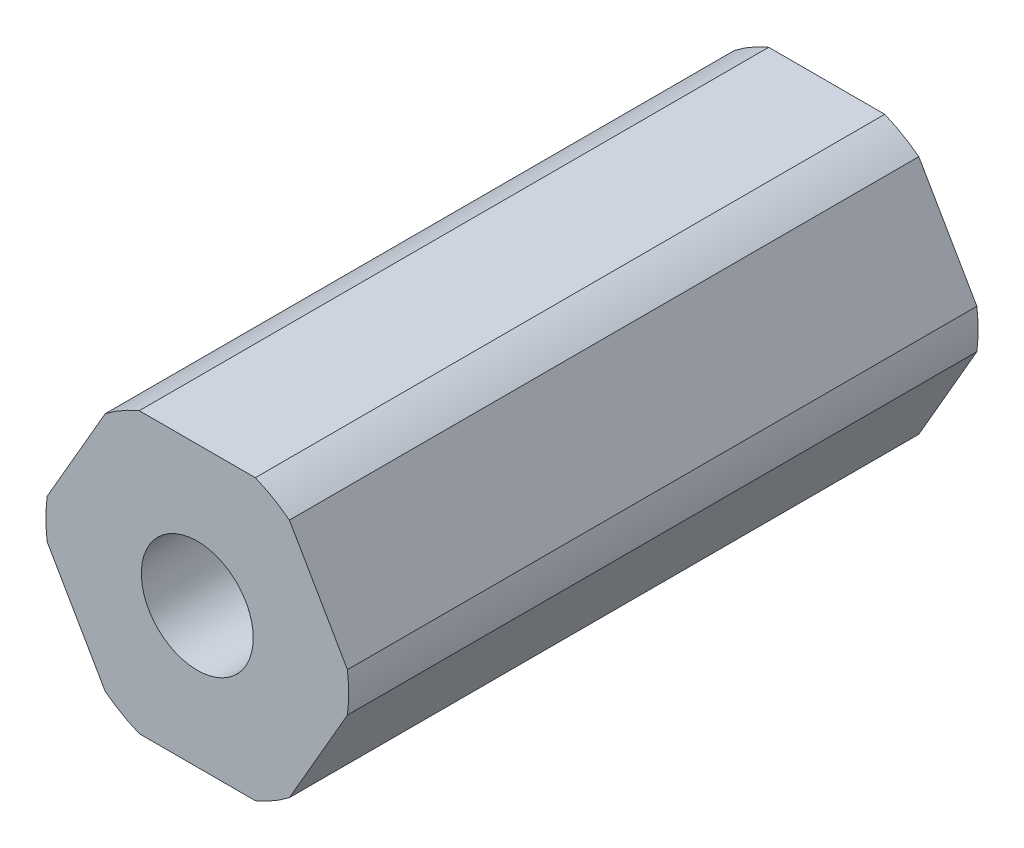
ISO-10303-21;
HEADER;
FILE_DESCRIPTION(('STEP AP214'),'2;1');
FILE_NAME('part.step','',(''),(''),'','','');
FILE_SCHEMA(('AUTOMOTIVE_DESIGN { 1 0 10303 214 1 1 1 1 }'));
ENDSEC;
DATA;
#1=APPLICATION_CONTEXT('core data for automotive mechanical design processes');
#2=APPLICATION_PROTOCOL_DEFINITION('international standard','automotive_design',2000,#1);
#3=PRODUCT_CONTEXT('',#1,'mechanical');
#4=PRODUCT('Part','Part','',(#3));
#5=PRODUCT_RELATED_PRODUCT_CATEGORY('part','',(#4));
#6=PRODUCT_DEFINITION_FORMATION('','',#4);
#7=PRODUCT_DEFINITION_CONTEXT('part definition',#1,'design');
#8=PRODUCT_DEFINITION('design','',#6,#7);
#9=PRODUCT_DEFINITION_SHAPE('','',#8);
#10=(LENGTH_UNIT() NAMED_UNIT(*) SI_UNIT(.MILLI.,.METRE.));
#11=(NAMED_UNIT(*) PLANE_ANGLE_UNIT() SI_UNIT($,.RADIAN.));
#12=(NAMED_UNIT(*) SI_UNIT($,.STERADIAN.) SOLID_ANGLE_UNIT());
#13=UNCERTAINTY_MEASURE_WITH_UNIT(LENGTH_MEASURE(1.E-05),#10,'distance_accuracy_value','');
#14=(GEOMETRIC_REPRESENTATION_CONTEXT(3) GLOBAL_UNCERTAINTY_ASSIGNED_CONTEXT((#13)) GLOBAL_UNIT_ASSIGNED_CONTEXT((#10,
#11,#12)) REPRESENTATION_CONTEXT('',''));
#15=CARTESIAN_POINT('',(0.,0.,0.));
#16=DIRECTION('',(0.,0.,1.));
#17=DIRECTION('',(1.,0.,0.));
#18=AXIS2_PLACEMENT_3D('',#15,#16,#17);
#19=CARTESIAN_POINT('',(0.,0.,28.575));
#20=DIRECTION('',(0.,0.,1.));
#21=DIRECTION('',(1.,0.,0.));
#22=AXIS2_PLACEMENT_3D('',#19,#20,#21);
#23=PLANE('',#22);
#24=CARTESIAN_POINT('',(0.,0.,28.575));
#25=DIRECTION('',(0.,0.,1.));
#26=DIRECTION('',(1.,0.,0.));
#27=AXIS2_PLACEMENT_3D('',#24,#25,#26);
#28=CIRCLE('',#27,6.87499999999999);
#29=CARTESIAN_POINT('',(6.81675182633098,-0.893039494206809,28.575));
#30=VERTEX_POINT('',#29);
#31=CARTESIAN_POINT('',(6.81675182633098,0.893039494206813,28.575));
#32=VERTEX_POINT('',#31);
#33=EDGE_CURVE('E177',#30,#32,#28,.T.);
#34=ORIENTED_EDGE('',*,*,#33,.T.);
#35=DIRECTION('',(-0.5,0.866025403784438,0.));
#36=VECTOR('',#35,1.);
#37=CARTESIAN_POINT('',(6.81675182633098,0.893039494206813,28.575));
#38=LINE('',#37,#36);
#39=CARTESIAN_POINT('',(4.18177080173139,5.45696050579319,28.575));
#40=VERTEX_POINT('',#39);
#41=EDGE_CURVE('E105',#32,#40,#38,.T.);
#42=ORIENTED_EDGE('',*,*,#41,.T.);
#43=CARTESIAN_POINT('',(0.,0.,28.575));
#44=DIRECTION('',(0.,0.,1.));
#45=DIRECTION('',(1.,0.,0.));
#46=AXIS2_PLACEMENT_3D('',#43,#44,#45);
#47=CIRCLE('',#46,6.87499999999999);
#48=CARTESIAN_POINT('',(2.63498102459958,6.35,28.575));
#49=VERTEX_POINT('',#48);
#50=EDGE_CURVE('E204',#40,#49,#47,.T.);
#51=ORIENTED_EDGE('',*,*,#50,.T.);
#52=DIRECTION('',(-1.,0.,0.));
#53=VECTOR('',#52,1.);
#54=CARTESIAN_POINT('',(2.63498102459958,6.35,28.575));
#55=LINE('',#54,#53);
#56=CARTESIAN_POINT('',(-2.63498102459958,6.35,28.575));
#57=VERTEX_POINT('',#56);
#58=EDGE_CURVE('E223',#49,#57,#55,.T.);
#59=ORIENTED_EDGE('',*,*,#58,.T.);
#60=CARTESIAN_POINT('',(0.,0.,28.575));
#61=DIRECTION('',(0.,0.,1.));
#62=DIRECTION('',(1.,0.,0.));
#63=AXIS2_PLACEMENT_3D('',#60,#61,#62);
#64=CIRCLE('',#63,6.87499999999999);
#65=CARTESIAN_POINT('',(-4.1817708017314,5.45696050579319,28.575));
#66=VERTEX_POINT('',#65);
#67=EDGE_CURVE('E220',#57,#66,#64,.T.);
#68=ORIENTED_EDGE('',*,*,#67,.T.);
#69=DIRECTION('',(-0.5,-0.866025403784439,0.));
#70=VECTOR('',#69,1.);
#71=CARTESIAN_POINT('',(-4.1817708017314,5.45696050579319,28.575));
#72=LINE('',#71,#70);
#73=CARTESIAN_POINT('',(-6.81675182633098,0.893039494206816,28.575));
#74=VERTEX_POINT('',#73);
#75=EDGE_CURVE('E222',#66,#74,#72,.T.);
#76=ORIENTED_EDGE('',*,*,#75,.T.);
#77=CARTESIAN_POINT('',(0.,0.,28.575));
#78=DIRECTION('',(0.,0.,1.));
#79=DIRECTION('',(1.,0.,0.));
#80=AXIS2_PLACEMENT_3D('',#77,#78,#79);
#81=CIRCLE('',#80,6.87499999999999);
#82=CARTESIAN_POINT('',(-6.81675182633098,-0.89303949420682,28.575));
#83=VERTEX_POINT('',#82);
#84=EDGE_CURVE('E225',#74,#83,#81,.T.);
#85=ORIENTED_EDGE('',*,*,#84,.T.);
#86=DIRECTION('',(0.5,-0.866025403784438,0.));
#87=VECTOR('',#86,1.);
#88=CARTESIAN_POINT('',(-6.81675182633098,-0.893039494206822,28.575));
#89=LINE('',#88,#87);
#90=CARTESIAN_POINT('',(-4.1817708017314,-5.45696050579319,28.575));
#91=VERTEX_POINT('',#90);
#92=EDGE_CURVE('E231',#83,#91,#89,.T.);
#93=ORIENTED_EDGE('',*,*,#92,.T.);
#94=CARTESIAN_POINT('',(0.,0.,28.575));
#95=DIRECTION('',(0.,0.,1.));
#96=DIRECTION('',(1.,0.,0.));
#97=AXIS2_PLACEMENT_3D('',#94,#95,#96);
#98=CIRCLE('',#97,6.87499999999999);
#99=CARTESIAN_POINT('',(-2.63498102459958,-6.35,28.575));
#100=VERTEX_POINT('',#99);
#101=EDGE_CURVE('E136',#91,#100,#98,.T.);
#102=ORIENTED_EDGE('',*,*,#101,.T.);
#103=DIRECTION('',(1.,0.,0.));
#104=VECTOR('',#103,1.);
#105=CARTESIAN_POINT('',(-2.63498102459958,-6.35,28.575));
#106=LINE('',#105,#104);
#107=CARTESIAN_POINT('',(2.63498102459958,-6.35,28.575));
#108=VERTEX_POINT('',#107);
#109=EDGE_CURVE('E130',#100,#108,#106,.T.);
#110=ORIENTED_EDGE('',*,*,#109,.T.);
#111=CARTESIAN_POINT('',(0.,0.,28.575));
#112=DIRECTION('',(0.,0.,1.));
#113=DIRECTION('',(1.,0.,0.));
#114=AXIS2_PLACEMENT_3D('',#111,#112,#113);
#115=CIRCLE('',#114,6.87499999999999);
#116=CARTESIAN_POINT('',(4.18177080173139,-5.45696050579319,28.575));
#117=VERTEX_POINT('',#116);
#118=EDGE_CURVE('E134',#108,#117,#115,.T.);
#119=ORIENTED_EDGE('',*,*,#118,.T.);
#120=DIRECTION('',(0.5,0.866025403784439,0.));
#121=VECTOR('',#120,1.);
#122=CARTESIAN_POINT('',(4.18177080173139,-5.45696050579319,28.575));
#123=LINE('',#122,#121);
#124=EDGE_CURVE('E50',#117,#30,#123,.T.);
#125=ORIENTED_EDGE('',*,*,#124,.T.);
#126=EDGE_LOOP('',(#34,#42,#51,#59,#68,#76,#85,#93,#102,#110,#119,#125));
#127=FACE_BOUND('',#126,.T.);
#128=CARTESIAN_POINT('',(0.,0.,28.575));
#129=DIRECTION('',(0.,0.,1.));
#130=DIRECTION('',(1.,0.,0.));
#131=AXIS2_PLACEMENT_3D('',#128,#129,#130);
#132=CIRCLE('',#131,2.54);
#133=CARTESIAN_POINT('',(2.54,0.,28.575));
#134=VERTEX_POINT('',#133);
#135=EDGE_CURVE('E158',#134,#134,#132,.T.);
#136=ORIENTED_EDGE('',*,*,#135,.F.);
#137=EDGE_LOOP('',(#136));
#138=FACE_BOUND('',#137,.T.);
#139=ADVANCED_FACE('F33',(#127,#138),#23,.T.);
#140=CARTESIAN_POINT('',(0.,0.,0.));
#141=DIRECTION('',(0.,0.,1.));
#142=DIRECTION('',(1.,0.,0.));
#143=AXIS2_PLACEMENT_3D('',#140,#141,#142);
#144=PLANE('',#143);
#145=CARTESIAN_POINT('',(0.,0.,0.));
#146=DIRECTION('',(0.,0.,1.));
#147=DIRECTION('',(1.,0.,0.));
#148=AXIS2_PLACEMENT_3D('',#145,#146,#147);
#149=CIRCLE('',#148,6.87499999999999);
#150=CARTESIAN_POINT('',(6.81675182633098,-0.893039494206809,0.));
#151=VERTEX_POINT('',#150);
#152=CARTESIAN_POINT('',(6.81675182633098,0.893039494206813,0.));
#153=VERTEX_POINT('',#152);
#154=EDGE_CURVE('E154',#151,#153,#149,.T.);
#155=ORIENTED_EDGE('',*,*,#154,.F.);
#156=DIRECTION('',(0.5,0.866025403784439,0.));
#157=VECTOR('',#156,1.);
#158=CARTESIAN_POINT('',(4.18177080173139,-5.45696050579319,0.));
#159=LINE('',#158,#157);
#160=CARTESIAN_POINT('',(4.18177080173139,-5.45696050579319,0.));
#161=VERTEX_POINT('',#160);
#162=EDGE_CURVE('E97',#161,#151,#159,.T.);
#163=ORIENTED_EDGE('',*,*,#162,.F.);
#164=CARTESIAN_POINT('',(0.,0.,0.));
#165=DIRECTION('',(0.,0.,1.));
#166=DIRECTION('',(1.,0.,0.));
#167=AXIS2_PLACEMENT_3D('',#164,#165,#166);
#168=CIRCLE('',#167,6.87499999999999);
#169=CARTESIAN_POINT('',(2.63498102459958,-6.35,0.));
#170=VERTEX_POINT('',#169);
#171=EDGE_CURVE('E91',#170,#161,#168,.T.);
#172=ORIENTED_EDGE('',*,*,#171,.F.);
#173=DIRECTION('',(1.,0.,0.));
#174=VECTOR('',#173,1.);
#175=CARTESIAN_POINT('',(-2.63498102459958,-6.35,0.));
#176=LINE('',#175,#174);
#177=CARTESIAN_POINT('',(-2.63498102459958,-6.35,0.));
#178=VERTEX_POINT('',#177);
#179=EDGE_CURVE('E144',#178,#170,#176,.T.);
#180=ORIENTED_EDGE('',*,*,#179,.F.);
#181=CARTESIAN_POINT('',(0.,0.,0.));
#182=DIRECTION('',(0.,0.,1.));
#183=DIRECTION('',(1.,0.,0.));
#184=AXIS2_PLACEMENT_3D('',#181,#182,#183);
#185=CIRCLE('',#184,6.87499999999999);
#186=CARTESIAN_POINT('',(-4.1817708017314,-5.45696050579319,0.));
#187=VERTEX_POINT('',#186);
#188=EDGE_CURVE('E172',#187,#178,#185,.T.);
#189=ORIENTED_EDGE('',*,*,#188,.F.);
#190=DIRECTION('',(0.5,-0.866025403784438,0.));
#191=VECTOR('',#190,1.);
#192=CARTESIAN_POINT('',(-6.81675182633098,-0.893039494206822,0.));
#193=LINE('',#192,#191);
#194=CARTESIAN_POINT('',(-6.81675182633098,-0.89303949420682,0.));
#195=VERTEX_POINT('',#194);
#196=EDGE_CURVE('E170',#195,#187,#193,.T.);
#197=ORIENTED_EDGE('',*,*,#196,.F.);
#198=CARTESIAN_POINT('',(0.,0.,0.));
#199=DIRECTION('',(0.,0.,1.));
#200=DIRECTION('',(1.,0.,0.));
#201=AXIS2_PLACEMENT_3D('',#198,#199,#200);
#202=CIRCLE('',#201,6.87499999999999);
#203=CARTESIAN_POINT('',(-6.81675182633098,0.893039494206816,0.));
#204=VERTEX_POINT('',#203);
#205=EDGE_CURVE('E168',#204,#195,#202,.T.);
#206=ORIENTED_EDGE('',*,*,#205,.F.);
#207=DIRECTION('',(-0.5,-0.866025403784439,0.));
#208=VECTOR('',#207,1.);
#209=CARTESIAN_POINT('',(-4.1817708017314,5.45696050579319,0.));
#210=LINE('',#209,#208);
#211=CARTESIAN_POINT('',(-4.1817708017314,5.45696050579319,0.));
#212=VERTEX_POINT('',#211);
#213=EDGE_CURVE('E166',#212,#204,#210,.T.);
#214=ORIENTED_EDGE('',*,*,#213,.F.);
#215=CARTESIAN_POINT('',(0.,0.,0.));
#216=DIRECTION('',(0.,0.,1.));
#217=DIRECTION('',(1.,0.,0.));
#218=AXIS2_PLACEMENT_3D('',#215,#216,#217);
#219=CIRCLE('',#218,6.87499999999999);
#220=CARTESIAN_POINT('',(-2.63498102459958,6.35,0.));
#221=VERTEX_POINT('',#220);
#222=EDGE_CURVE('E164',#221,#212,#219,.T.);
#223=ORIENTED_EDGE('',*,*,#222,.F.);
#224=DIRECTION('',(-1.,0.,0.));
#225=VECTOR('',#224,1.);
#226=CARTESIAN_POINT('',(2.63498102459958,6.35,0.));
#227=LINE('',#226,#225);
#228=CARTESIAN_POINT('',(2.63498102459958,6.35,0.));
#229=VERTEX_POINT('',#228);
#230=EDGE_CURVE('E162',#229,#221,#227,.T.);
#231=ORIENTED_EDGE('',*,*,#230,.F.);
#232=CARTESIAN_POINT('',(0.,0.,0.));
#233=DIRECTION('',(0.,0.,1.));
#234=DIRECTION('',(1.,0.,0.));
#235=AXIS2_PLACEMENT_3D('',#232,#233,#234);
#236=CIRCLE('',#235,6.87499999999999);
#237=CARTESIAN_POINT('',(4.18177080173139,5.45696050579319,0.));
#238=VERTEX_POINT('',#237);
#239=EDGE_CURVE('E160',#238,#229,#236,.T.);
#240=ORIENTED_EDGE('',*,*,#239,.F.);
#241=DIRECTION('',(-0.5,0.866025403784438,0.));
#242=VECTOR('',#241,1.);
#243=CARTESIAN_POINT('',(6.81675182633098,0.893039494206813,0.));
#244=LINE('',#243,#242);
#245=EDGE_CURVE('E157',#153,#238,#244,.T.);
#246=ORIENTED_EDGE('',*,*,#245,.F.);
#247=EDGE_LOOP('',(#155,#163,#172,#180,#189,#197,#206,#214,#223,#231,#240,#246));
#248=FACE_BOUND('',#247,.T.);
#249=CARTESIAN_POINT('',(0.,0.,0.));
#250=DIRECTION('',(0.,0.,1.));
#251=DIRECTION('',(1.,0.,0.));
#252=AXIS2_PLACEMENT_3D('',#249,#250,#251);
#253=CIRCLE('',#252,2.54);
#254=CARTESIAN_POINT('',(2.54,0.,0.));
#255=VERTEX_POINT('',#254);
#256=EDGE_CURVE('E378',#255,#255,#253,.T.);
#257=ORIENTED_EDGE('',*,*,#256,.T.);
#258=EDGE_LOOP('',(#257));
#259=FACE_BOUND('',#258,.T.);
#260=ADVANCED_FACE('F208',(#248,#259),#144,.F.);
#261=CARTESIAN_POINT('',(0.,0.,28.575));
#262=DIRECTION('',(0.,0.,-1.));
#263=DIRECTION('',(-1.,0.,0.));
#264=AXIS2_PLACEMENT_3D('',#261,#262,#263);
#265=CYLINDRICAL_SURFACE('',#264,6.87499999999999);
#266=ORIENTED_EDGE('',*,*,#154,.T.);
#267=DIRECTION('',(0.,0.,-1.));
#268=VECTOR('',#267,1.);
#269=CARTESIAN_POINT('',(6.81675182633098,0.893039494206813,28.575));
#270=LINE('',#269,#268);
#271=EDGE_CURVE('E11',#32,#153,#270,.T.);
#272=ORIENTED_EDGE('',*,*,#271,.F.);
#273=ORIENTED_EDGE('',*,*,#33,.F.);
#274=DIRECTION('',(0.,0.,-1.));
#275=VECTOR('',#274,1.);
#276=CARTESIAN_POINT('',(6.81675182633098,-0.893039494206809,28.575));
#277=LINE('',#276,#275);
#278=EDGE_CURVE('E150',#30,#151,#277,.T.);
#279=ORIENTED_EDGE('',*,*,#278,.T.);
#280=EDGE_LOOP('',(#266,#272,#273,#279));
#281=FACE_BOUND('',#280,.T.);
#282=ADVANCED_FACE('F35',(#281),#265,.T.);
#283=CARTESIAN_POINT('',(6.81675182633098,0.893039494206813,28.575));
#284=DIRECTION('',(-0.866025403784438,-0.5,0.));
#285=DIRECTION('',(0.5,-0.866025403784439,0.));
#286=AXIS2_PLACEMENT_3D('',#283,#284,#285);
#287=PLANE('',#286);
#288=ORIENTED_EDGE('',*,*,#245,.T.);
#289=DIRECTION('',(0.,0.,-1.));
#290=VECTOR('',#289,1.);
#291=CARTESIAN_POINT('',(4.18177080173139,5.45696050579319,28.575));
#292=LINE('',#291,#290);
#293=EDGE_CURVE('E42',#40,#238,#292,.T.);
#294=ORIENTED_EDGE('',*,*,#293,.F.);
#295=ORIENTED_EDGE('',*,*,#41,.F.);
#296=ORIENTED_EDGE('',*,*,#271,.T.);
#297=EDGE_LOOP('',(#288,#294,#295,#296));
#298=FACE_BOUND('',#297,.T.);
#299=ADVANCED_FACE('F265',(#298),#287,.F.);
#300=CARTESIAN_POINT('',(0.,0.,28.575));
#301=DIRECTION('',(0.,0.,-1.));
#302=DIRECTION('',(-1.,0.,0.));
#303=AXIS2_PLACEMENT_3D('',#300,#301,#302);
#304=CYLINDRICAL_SURFACE('',#303,6.87499999999999);
#305=ORIENTED_EDGE('',*,*,#239,.T.);
#306=DIRECTION('',(0.,0.,-1.));
#307=VECTOR('',#306,1.);
#308=CARTESIAN_POINT('',(2.63498102459958,6.35,28.575));
#309=LINE('',#308,#307);
#310=EDGE_CURVE('E196',#49,#229,#309,.T.);
#311=ORIENTED_EDGE('',*,*,#310,.F.);
#312=ORIENTED_EDGE('',*,*,#50,.F.);
#313=ORIENTED_EDGE('',*,*,#293,.T.);
#314=EDGE_LOOP('',(#305,#311,#312,#313));
#315=FACE_BOUND('',#314,.T.);
#316=ADVANCED_FACE('F202',(#315),#304,.T.);
#317=CARTESIAN_POINT('',(2.63498102459958,6.35,28.575));
#318=DIRECTION('',(0.,-1.,0.));
#319=DIRECTION('',(0.,0.,-1.));
#320=AXIS2_PLACEMENT_3D('',#317,#318,#319);
#321=PLANE('',#320);
#322=ORIENTED_EDGE('',*,*,#230,.T.);
#323=DIRECTION('',(0.,0.,-1.));
#324=VECTOR('',#323,1.);
#325=CARTESIAN_POINT('',(-2.63498102459958,6.35,28.575));
#326=LINE('',#325,#324);
#327=EDGE_CURVE('E193',#57,#221,#326,.T.);
#328=ORIENTED_EDGE('',*,*,#327,.F.);
#329=ORIENTED_EDGE('',*,*,#58,.F.);
#330=ORIENTED_EDGE('',*,*,#310,.T.);
#331=EDGE_LOOP('',(#322,#328,#329,#330));
#332=FACE_BOUND('',#331,.T.);
#333=ADVANCED_FACE('F214',(#332),#321,.F.);
#334=CARTESIAN_POINT('',(0.,0.,28.575));
#335=DIRECTION('',(0.,0.,-1.));
#336=DIRECTION('',(-1.,0.,0.));
#337=AXIS2_PLACEMENT_3D('',#334,#335,#336);
#338=CYLINDRICAL_SURFACE('',#337,6.87499999999999);
#339=ORIENTED_EDGE('',*,*,#222,.T.);
#340=DIRECTION('',(0.,0.,-1.));
#341=VECTOR('',#340,1.);
#342=CARTESIAN_POINT('',(-4.1817708017314,5.45696050579319,28.575));
#343=LINE('',#342,#341);
#344=EDGE_CURVE('E190',#66,#212,#343,.T.);
#345=ORIENTED_EDGE('',*,*,#344,.F.);
#346=ORIENTED_EDGE('',*,*,#67,.F.);
#347=ORIENTED_EDGE('',*,*,#327,.T.);
#348=EDGE_LOOP('',(#339,#345,#346,#347));
#349=FACE_BOUND('',#348,.T.);
#350=ADVANCED_FACE('F218',(#349),#338,.T.);
#351=CARTESIAN_POINT('',(-4.1817708017314,5.45696050579319,28.575));
#352=DIRECTION('',(0.866025403784439,-0.5,0.));
#353=DIRECTION('',(0.5,0.866025403784439,0.));
#354=AXIS2_PLACEMENT_3D('',#351,#352,#353);
#355=PLANE('',#354);
#356=ORIENTED_EDGE('',*,*,#213,.T.);
#357=DIRECTION('',(0.,0.,-1.));
#358=VECTOR('',#357,1.);
#359=CARTESIAN_POINT('',(-6.81675182633098,0.893039494206816,28.575));
#360=LINE('',#359,#358);
#361=EDGE_CURVE('E187',#74,#204,#360,.T.);
#362=ORIENTED_EDGE('',*,*,#361,.F.);
#363=ORIENTED_EDGE('',*,*,#75,.F.);
#364=ORIENTED_EDGE('',*,*,#344,.T.);
#365=EDGE_LOOP('',(#356,#362,#363,#364));
#366=FACE_BOUND('',#365,.T.);
#367=ADVANCED_FACE('F278',(#366),#355,.F.);
#368=CARTESIAN_POINT('',(0.,0.,28.575));
#369=DIRECTION('',(0.,0.,-1.));
#370=DIRECTION('',(-1.,0.,0.));
#371=AXIS2_PLACEMENT_3D('',#368,#369,#370);
#372=CYLINDRICAL_SURFACE('',#371,6.87499999999999);
#373=ORIENTED_EDGE('',*,*,#205,.T.);
#374=DIRECTION('',(0.,0.,-1.));
#375=VECTOR('',#374,1.);
#376=CARTESIAN_POINT('',(-6.81675182633098,-0.89303949420682,28.575));
#377=LINE('',#376,#375);
#378=EDGE_CURVE('E184',#83,#195,#377,.T.);
#379=ORIENTED_EDGE('',*,*,#378,.F.);
#380=ORIENTED_EDGE('',*,*,#84,.F.);
#381=ORIENTED_EDGE('',*,*,#361,.T.);
#382=EDGE_LOOP('',(#373,#379,#380,#381));
#383=FACE_BOUND('',#382,.T.);
#384=ADVANCED_FACE('F281',(#383),#372,.T.);
#385=CARTESIAN_POINT('',(-6.81675182633098,-0.893039494206822,28.575));
#386=DIRECTION('',(0.866025403784439,0.500000000000001,0.));
#387=DIRECTION('',(-0.5,0.866025403784438,0.));
#388=AXIS2_PLACEMENT_3D('',#385,#386,#387);
#389=PLANE('',#388);
#390=ORIENTED_EDGE('',*,*,#196,.T.);
#391=DIRECTION('',(0.,0.,-1.));
#392=VECTOR('',#391,1.);
#393=CARTESIAN_POINT('',(-4.1817708017314,-5.45696050579319,28.575));
#394=LINE('',#393,#392);
#395=EDGE_CURVE('E181',#91,#187,#394,.T.);
#396=ORIENTED_EDGE('',*,*,#395,.F.);
#397=ORIENTED_EDGE('',*,*,#92,.F.);
#398=ORIENTED_EDGE('',*,*,#378,.T.);
#399=EDGE_LOOP('',(#390,#396,#397,#398));
#400=FACE_BOUND('',#399,.T.);
#401=ADVANCED_FACE('F237',(#400),#389,.F.);
#402=CARTESIAN_POINT('',(0.,0.,28.575));
#403=DIRECTION('',(0.,0.,-1.));
#404=DIRECTION('',(-1.,0.,0.));
#405=AXIS2_PLACEMENT_3D('',#402,#403,#404);
#406=CYLINDRICAL_SURFACE('',#405,6.87499999999999);
#407=ORIENTED_EDGE('',*,*,#188,.T.);
#408=DIRECTION('',(0.,0.,-1.));
#409=VECTOR('',#408,1.);
#410=CARTESIAN_POINT('',(-2.63498102459958,-6.35,28.575));
#411=LINE('',#410,#409);
#412=EDGE_CURVE('E145',#100,#178,#411,.T.);
#413=ORIENTED_EDGE('',*,*,#412,.F.);
#414=ORIENTED_EDGE('',*,*,#101,.F.);
#415=ORIENTED_EDGE('',*,*,#395,.T.);
#416=EDGE_LOOP('',(#407,#413,#414,#415));
#417=FACE_BOUND('',#416,.T.);
#418=ADVANCED_FACE('F241',(#417),#406,.T.);
#419=CARTESIAN_POINT('',(-2.63498102459958,-6.35,28.575));
#420=DIRECTION('',(0.,1.,0.));
#421=DIRECTION('',(-1.,0.,0.));
#422=AXIS2_PLACEMENT_3D('',#419,#420,#421);
#423=PLANE('',#422);
#424=ORIENTED_EDGE('',*,*,#179,.T.);
#425=DIRECTION('',(0.,0.,-1.));
#426=VECTOR('',#425,1.);
#427=CARTESIAN_POINT('',(2.63498102459958,-6.35,28.575));
#428=LINE('',#427,#426);
#429=EDGE_CURVE('E141',#108,#170,#428,.T.);
#430=ORIENTED_EDGE('',*,*,#429,.F.);
#431=ORIENTED_EDGE('',*,*,#109,.F.);
#432=ORIENTED_EDGE('',*,*,#412,.T.);
#433=EDGE_LOOP('',(#424,#430,#431,#432));
#434=FACE_BOUND('',#433,.T.);
#435=ADVANCED_FACE('F142',(#434),#423,.F.);
#436=CARTESIAN_POINT('',(0.,0.,28.575));
#437=DIRECTION('',(0.,0.,-1.));
#438=DIRECTION('',(-1.,0.,0.));
#439=AXIS2_PLACEMENT_3D('',#436,#437,#438);
#440=CYLINDRICAL_SURFACE('',#439,6.87499999999999);
#441=ORIENTED_EDGE('',*,*,#171,.T.);
#442=DIRECTION('',(0.,0.,-1.));
#443=VECTOR('',#442,1.);
#444=CARTESIAN_POINT('',(4.18177080173139,-5.45696050579319,28.575));
#445=LINE('',#444,#443);
#446=EDGE_CURVE('E146',#117,#161,#445,.T.);
#447=ORIENTED_EDGE('',*,*,#446,.F.);
#448=ORIENTED_EDGE('',*,*,#118,.F.);
#449=ORIENTED_EDGE('',*,*,#429,.T.);
#450=EDGE_LOOP('',(#441,#447,#448,#449));
#451=FACE_BOUND('',#450,.T.);
#452=ADVANCED_FACE('F148',(#451),#440,.T.);
#453=CARTESIAN_POINT('',(4.18177080173139,-5.45696050579319,28.575));
#454=DIRECTION('',(-0.866025403784439,0.5,0.));
#455=DIRECTION('',(-0.5,-0.866025403784439,0.));
#456=AXIS2_PLACEMENT_3D('',#453,#454,#455);
#457=PLANE('',#456);
#458=ORIENTED_EDGE('',*,*,#162,.T.);
#459=ORIENTED_EDGE('',*,*,#278,.F.);
#460=ORIENTED_EDGE('',*,*,#124,.F.);
#461=ORIENTED_EDGE('',*,*,#446,.T.);
#462=EDGE_LOOP('',(#458,#459,#460,#461));
#463=FACE_BOUND('',#462,.T.);
#464=ADVANCED_FACE('F245',(#463),#457,.F.);
#465=CARTESIAN_POINT('',(0.,0.,28.575));
#466=DIRECTION('',(0.,0.,-1.));
#467=DIRECTION('',(-1.,0.,0.));
#468=AXIS2_PLACEMENT_3D('',#465,#466,#467);
#469=CYLINDRICAL_SURFACE('',#468,2.54);
#470=ORIENTED_EDGE('',*,*,#135,.T.);
#471=EDGE_LOOP('',(#470));
#472=FACE_BOUND('',#471,.T.);
#473=ORIENTED_EDGE('',*,*,#256,.F.);
#474=EDGE_LOOP('',(#473));
#475=FACE_BOUND('',#474,.T.);
#476=ADVANCED_FACE('F247',(#472,#475),#469,.F.);
#477=CLOSED_SHELL('',(#139,#260,#282,#299,#316,#333,#350,#367,#384,#401,#418,#435,#452,#464,#476));
#478=MANIFOLD_SOLID_BREP('B2',#477);
#479=ADVANCED_BREP_SHAPE_REPRESENTATION('',(#18,#478),#14);
#480=SHAPE_DEFINITION_REPRESENTATION(#9,#479);
ENDSEC;
END-ISO-10303-21;
